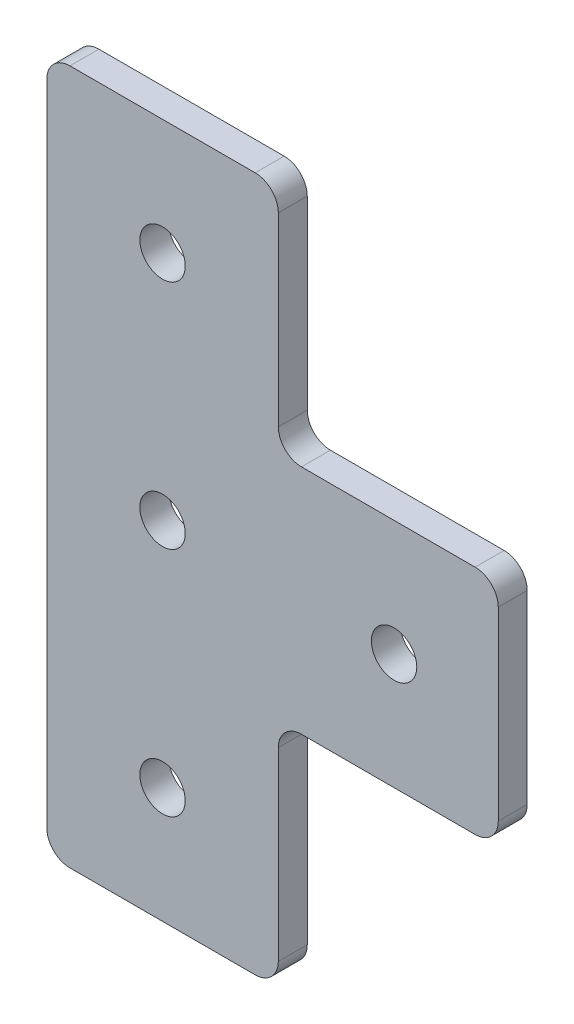
ISO-10303-21;
HEADER;
FILE_DESCRIPTION(('STEP AP214'),'2;1');
FILE_NAME('part.step','',(''),(''),'','','');
FILE_SCHEMA(('AUTOMOTIVE_DESIGN { 1 0 10303 214 1 1 1 1 }'));
ENDSEC;
DATA;
#1=APPLICATION_CONTEXT('core data for automotive mechanical design processes');
#2=APPLICATION_PROTOCOL_DEFINITION('international standard','automotive_design',2000,#1);
#3=PRODUCT_CONTEXT('',#1,'mechanical');
#4=PRODUCT('Part','Part','',(#3));
#5=PRODUCT_RELATED_PRODUCT_CATEGORY('part','',(#4));
#6=PRODUCT_DEFINITION_FORMATION('','',#4);
#7=PRODUCT_DEFINITION_CONTEXT('part definition',#1,'design');
#8=PRODUCT_DEFINITION('design','',#6,#7);
#9=PRODUCT_DEFINITION_SHAPE('','',#8);
#10=(LENGTH_UNIT() NAMED_UNIT(*) SI_UNIT(.MILLI.,.METRE.));
#11=(NAMED_UNIT(*) PLANE_ANGLE_UNIT() SI_UNIT($,.RADIAN.));
#12=(NAMED_UNIT(*) SI_UNIT($,.STERADIAN.) SOLID_ANGLE_UNIT());
#13=UNCERTAINTY_MEASURE_WITH_UNIT(LENGTH_MEASURE(1.E-05),#10,'distance_accuracy_value','');
#14=(GEOMETRIC_REPRESENTATION_CONTEXT(3) GLOBAL_UNCERTAINTY_ASSIGNED_CONTEXT((#13)) GLOBAL_UNIT_ASSIGNED_CONTEXT((#10,
#11,#12)) REPRESENTATION_CONTEXT('',''));
#15=CARTESIAN_POINT('',(0.,0.,0.));
#16=DIRECTION('',(0.,0.,1.));
#17=DIRECTION('',(1.,0.,0.));
#18=AXIS2_PLACEMENT_3D('',#15,#16,#17);
#19=CARTESIAN_POINT('',(-2.54,2.54,3.175));
#20=DIRECTION('',(0.,0.,1.));
#21=DIRECTION('',(1.,0.,0.));
#22=AXIS2_PLACEMENT_3D('',#19,#20,#21);
#23=PLANE('',#22);
#24=CARTESIAN_POINT('',(-36.83,-12.7,3.175));
#25=DIRECTION('',(0.,0.,1.));
#26=DIRECTION('',(1.,0.,0.));
#27=AXIS2_PLACEMENT_3D('',#24,#25,#26);
#28=CIRCLE('',#27,2.4892);
#29=CARTESIAN_POINT('',(-34.3408,-12.7,3.175));
#30=VERTEX_POINT('',#29);
#31=EDGE_CURVE('E343',#30,#30,#28,.T.);
#32=ORIENTED_EDGE('',*,*,#31,.F.);
#33=EDGE_LOOP('',(#32));
#34=FACE_BOUND('',#33,.T.);
#35=CARTESIAN_POINT('',(-36.83,38.1,3.175));
#36=DIRECTION('',(0.,0.,1.));
#37=DIRECTION('',(1.,0.,0.));
#38=AXIS2_PLACEMENT_3D('',#35,#36,#37);
#39=CIRCLE('',#38,2.4892);
#40=CARTESIAN_POINT('',(-34.3408,38.1,3.175));
#41=VERTEX_POINT('',#40);
#42=EDGE_CURVE('E182',#41,#41,#39,.T.);
#43=ORIENTED_EDGE('',*,*,#42,.F.);
#44=EDGE_LOOP('',(#43));
#45=FACE_BOUND('',#44,.T.);
#46=CARTESIAN_POINT('',(-2.54,2.54,3.175));
#47=DIRECTION('',(0.,0.,1.));
#48=DIRECTION('',(1.,0.,0.));
#49=AXIS2_PLACEMENT_3D('',#46,#47,#48);
#50=CIRCLE('',#49,2.54);
#51=CARTESIAN_POINT('',(-2.54000000000002,0.,3.175));
#52=VERTEX_POINT('',#51);
#53=CARTESIAN_POINT('',(0.,2.54000000000002,3.175));
#54=VERTEX_POINT('',#53);
#55=EDGE_CURVE('E209',#52,#54,#50,.T.);
#56=ORIENTED_EDGE('',*,*,#55,.T.);
#57=DIRECTION('',(0.,1.,0.));
#58=VECTOR('',#57,1.);
#59=CARTESIAN_POINT('',(0.,22.86,3.175));
#60=LINE('',#59,#58);
#61=CARTESIAN_POINT('',(0.,22.86,3.175));
#62=VERTEX_POINT('',#61);
#63=EDGE_CURVE('E117',#54,#62,#60,.T.);
#64=ORIENTED_EDGE('',*,*,#63,.T.);
#65=CARTESIAN_POINT('',(-2.54,22.86,3.175));
#66=DIRECTION('',(0.,0.,1.));
#67=DIRECTION('',(-1.,0.,0.));
#68=AXIS2_PLACEMENT_3D('',#65,#66,#67);
#69=CIRCLE('',#68,2.54);
#70=CARTESIAN_POINT('',(-2.54000000000002,25.4,3.175));
#71=VERTEX_POINT('',#70);
#72=EDGE_CURVE('E248',#62,#71,#69,.T.);
#73=ORIENTED_EDGE('',*,*,#72,.T.);
#74=DIRECTION('',(-1.,0.,0.));
#75=VECTOR('',#74,1.);
#76=CARTESIAN_POINT('',(-21.59,25.4,3.175));
#77=LINE('',#76,#75);
#78=CARTESIAN_POINT('',(-21.59,25.4,3.175));
#79=VERTEX_POINT('',#78);
#80=EDGE_CURVE('E267',#71,#79,#77,.T.);
#81=ORIENTED_EDGE('',*,*,#80,.T.);
#82=CARTESIAN_POINT('',(-21.59,27.94,3.175));
#83=DIRECTION('',(0.,0.,-1.));
#84=DIRECTION('',(1.,0.,0.));
#85=AXIS2_PLACEMENT_3D('',#82,#83,#84);
#86=CIRCLE('',#85,2.54);
#87=CARTESIAN_POINT('',(-24.13,27.94,3.175));
#88=VERTEX_POINT('',#87);
#89=EDGE_CURVE('E264',#79,#88,#86,.T.);
#90=ORIENTED_EDGE('',*,*,#89,.T.);
#91=DIRECTION('',(0.,1.,0.));
#92=VECTOR('',#91,1.);
#93=CARTESIAN_POINT('',(-24.13,48.26,3.175));
#94=LINE('',#93,#92);
#95=CARTESIAN_POINT('',(-24.13,48.26,3.175));
#96=VERTEX_POINT('',#95);
#97=EDGE_CURVE('E266',#88,#96,#94,.T.);
#98=ORIENTED_EDGE('',*,*,#97,.T.);
#99=CARTESIAN_POINT('',(-26.67,48.26,3.175));
#100=DIRECTION('',(0.,0.,1.));
#101=DIRECTION('',(-1.,0.,0.));
#102=AXIS2_PLACEMENT_3D('',#99,#100,#101);
#103=CIRCLE('',#102,2.54);
#104=CARTESIAN_POINT('',(-26.67,50.8,3.175));
#105=VERTEX_POINT('',#104);
#106=EDGE_CURVE('E269',#96,#105,#103,.T.);
#107=ORIENTED_EDGE('',*,*,#106,.T.);
#108=DIRECTION('',(-1.,0.,0.));
#109=VECTOR('',#108,1.);
#110=CARTESIAN_POINT('',(-46.99,50.8,3.175));
#111=LINE('',#110,#109);
#112=CARTESIAN_POINT('',(-46.99,50.8,3.175));
#113=VERTEX_POINT('',#112);
#114=EDGE_CURVE('E275',#105,#113,#111,.T.);
#115=ORIENTED_EDGE('',*,*,#114,.T.);
#116=CARTESIAN_POINT('',(-46.99,48.26,3.175));
#117=DIRECTION('',(0.,0.,1.));
#118=DIRECTION('',(-1.,0.,0.));
#119=AXIS2_PLACEMENT_3D('',#116,#117,#118);
#120=CIRCLE('',#119,2.54);
#121=CARTESIAN_POINT('',(-49.53,48.26,3.175));
#122=VERTEX_POINT('',#121);
#123=EDGE_CURVE('E277',#113,#122,#120,.T.);
#124=ORIENTED_EDGE('',*,*,#123,.T.);
#125=DIRECTION('',(0.,-1.,0.));
#126=VECTOR('',#125,1.);
#127=CARTESIAN_POINT('',(-49.53,-22.86,3.175));
#128=LINE('',#127,#126);
#129=CARTESIAN_POINT('',(-49.53,-22.86,3.175));
#130=VERTEX_POINT('',#129);
#131=EDGE_CURVE('E279',#122,#130,#128,.T.);
#132=ORIENTED_EDGE('',*,*,#131,.T.);
#133=CARTESIAN_POINT('',(-46.99,-22.86,3.175));
#134=DIRECTION('',(0.,0.,1.));
#135=DIRECTION('',(-1.,0.,0.));
#136=AXIS2_PLACEMENT_3D('',#133,#134,#135);
#137=CIRCLE('',#136,2.54);
#138=CARTESIAN_POINT('',(-46.99,-25.4,3.175));
#139=VERTEX_POINT('',#138);
#140=EDGE_CURVE('E281',#130,#139,#137,.T.);
#141=ORIENTED_EDGE('',*,*,#140,.T.);
#142=DIRECTION('',(1.,0.,0.));
#143=VECTOR('',#142,1.);
#144=CARTESIAN_POINT('',(-26.67,-25.4,3.175));
#145=LINE('',#144,#143);
#146=CARTESIAN_POINT('',(-26.67,-25.4,3.175));
#147=VERTEX_POINT('',#146);
#148=EDGE_CURVE('E283',#139,#147,#145,.T.);
#149=ORIENTED_EDGE('',*,*,#148,.T.);
#150=CARTESIAN_POINT('',(-26.67,-22.86,3.175));
#151=DIRECTION('',(0.,0.,1.));
#152=DIRECTION('',(-1.,0.,0.));
#153=AXIS2_PLACEMENT_3D('',#150,#151,#152);
#154=CIRCLE('',#153,2.54);
#155=CARTESIAN_POINT('',(-24.13,-22.86,3.175));
#156=VERTEX_POINT('',#155);
#157=EDGE_CURVE('E160',#147,#156,#154,.T.);
#158=ORIENTED_EDGE('',*,*,#157,.T.);
#159=DIRECTION('',(0.,1.,0.));
#160=VECTOR('',#159,1.);
#161=CARTESIAN_POINT('',(-24.13,-2.54000000000002,3.175));
#162=LINE('',#161,#160);
#163=CARTESIAN_POINT('',(-24.13,-2.54000000000002,3.175));
#164=VERTEX_POINT('',#163);
#165=EDGE_CURVE('E154',#156,#164,#162,.T.);
#166=ORIENTED_EDGE('',*,*,#165,.T.);
#167=CARTESIAN_POINT('',(-21.59,-2.54,3.175));
#168=DIRECTION('',(0.,0.,-1.));
#169=DIRECTION('',(1.,0.,0.));
#170=AXIS2_PLACEMENT_3D('',#167,#168,#169);
#171=CIRCLE('',#170,2.54);
#172=CARTESIAN_POINT('',(-21.59,0.,3.175));
#173=VERTEX_POINT('',#172);
#174=EDGE_CURVE('E158',#164,#173,#171,.T.);
#175=ORIENTED_EDGE('',*,*,#174,.T.);
#176=DIRECTION('',(1.,0.,0.));
#177=VECTOR('',#176,1.);
#178=CARTESIAN_POINT('',(-2.54000000000002,0.,3.175));
#179=LINE('',#178,#177);
#180=EDGE_CURVE('E50',#173,#52,#179,.T.);
#181=ORIENTED_EDGE('',*,*,#180,.T.);
#182=EDGE_LOOP('',(#56,#64,#73,#81,#90,#98,#107,#115,#124,#132,#141,#149,#158,#166,#175,#181));
#183=FACE_BOUND('',#182,.T.);
#184=CARTESIAN_POINT('',(-36.83,12.7,3.175));
#185=DIRECTION('',(0.,0.,1.));
#186=DIRECTION('',(1.,0.,0.));
#187=AXIS2_PLACEMENT_3D('',#184,#185,#186);
#188=CIRCLE('',#187,2.4892);
#189=CARTESIAN_POINT('',(-34.3408,12.7,3.175));
#190=VERTEX_POINT('',#189);
#191=EDGE_CURVE('E349',#190,#190,#188,.T.);
#192=ORIENTED_EDGE('',*,*,#191,.F.);
#193=EDGE_LOOP('',(#192));
#194=FACE_BOUND('',#193,.T.);
#195=CARTESIAN_POINT('',(-11.43,12.7,3.175));
#196=DIRECTION('',(0.,0.,1.));
#197=DIRECTION('',(1.,0.,0.));
#198=AXIS2_PLACEMENT_3D('',#195,#196,#197);
#199=CIRCLE('',#198,2.4892);
#200=CARTESIAN_POINT('',(-8.94080000000002,12.7,3.175));
#201=VERTEX_POINT('',#200);
#202=EDGE_CURVE('E334',#201,#201,#199,.T.);
#203=ORIENTED_EDGE('',*,*,#202,.F.);
#204=EDGE_LOOP('',(#203));
#205=FACE_BOUND('',#204,.T.);
#206=ADVANCED_FACE('F33',(#34,#45,#183,#194,#205),#23,.T.);
#207=CARTESIAN_POINT('',(-2.54,2.54,0.));
#208=DIRECTION('',(0.,0.,1.));
#209=DIRECTION('',(1.,0.,0.));
#210=AXIS2_PLACEMENT_3D('',#207,#208,#209);
#211=PLANE('',#210);
#212=CARTESIAN_POINT('',(-2.54,2.54,0.));
#213=DIRECTION('',(0.,0.,1.));
#214=DIRECTION('',(1.,0.,0.));
#215=AXIS2_PLACEMENT_3D('',#212,#213,#214);
#216=CIRCLE('',#215,2.54);
#217=CARTESIAN_POINT('',(-2.54000000000002,0.,0.));
#218=VERTEX_POINT('',#217);
#219=CARTESIAN_POINT('',(0.,2.54000000000002,0.));
#220=VERTEX_POINT('',#219);
#221=EDGE_CURVE('E178',#218,#220,#216,.T.);
#222=ORIENTED_EDGE('',*,*,#221,.F.);
#223=DIRECTION('',(1.,0.,0.));
#224=VECTOR('',#223,1.);
#225=CARTESIAN_POINT('',(-2.54000000000002,0.,0.));
#226=LINE('',#225,#224);
#227=CARTESIAN_POINT('',(-21.59,0.,0.));
#228=VERTEX_POINT('',#227);
#229=EDGE_CURVE('E109',#228,#218,#226,.T.);
#230=ORIENTED_EDGE('',*,*,#229,.F.);
#231=CARTESIAN_POINT('',(-21.59,-2.54,0.));
#232=DIRECTION('',(0.,0.,-1.));
#233=DIRECTION('',(1.,0.,0.));
#234=AXIS2_PLACEMENT_3D('',#231,#232,#233);
#235=CIRCLE('',#234,2.54);
#236=CARTESIAN_POINT('',(-24.13,-2.54000000000002,0.));
#237=VERTEX_POINT('',#236);
#238=EDGE_CURVE('E103',#237,#228,#235,.T.);
#239=ORIENTED_EDGE('',*,*,#238,.F.);
#240=DIRECTION('',(0.,1.,0.));
#241=VECTOR('',#240,1.);
#242=CARTESIAN_POINT('',(-24.13,-2.54000000000002,0.));
#243=LINE('',#242,#241);
#244=CARTESIAN_POINT('',(-24.13,-22.86,0.));
#245=VERTEX_POINT('',#244);
#246=EDGE_CURVE('E168',#245,#237,#243,.T.);
#247=ORIENTED_EDGE('',*,*,#246,.F.);
#248=CARTESIAN_POINT('',(-26.67,-22.86,0.));
#249=DIRECTION('',(0.,0.,1.));
#250=DIRECTION('',(-1.,0.,0.));
#251=AXIS2_PLACEMENT_3D('',#248,#249,#250);
#252=CIRCLE('',#251,2.54);
#253=CARTESIAN_POINT('',(-26.67,-25.4,0.));
#254=VERTEX_POINT('',#253);
#255=EDGE_CURVE('E204',#254,#245,#252,.T.);
#256=ORIENTED_EDGE('',*,*,#255,.F.);
#257=DIRECTION('',(1.,0.,0.));
#258=VECTOR('',#257,1.);
#259=CARTESIAN_POINT('',(-26.67,-25.4,0.));
#260=LINE('',#259,#258);
#261=CARTESIAN_POINT('',(-46.99,-25.4,0.));
#262=VERTEX_POINT('',#261);
#263=EDGE_CURVE('E202',#262,#254,#260,.T.);
#264=ORIENTED_EDGE('',*,*,#263,.F.);
#265=CARTESIAN_POINT('',(-46.99,-22.86,0.));
#266=DIRECTION('',(0.,0.,1.));
#267=DIRECTION('',(-1.,0.,0.));
#268=AXIS2_PLACEMENT_3D('',#265,#266,#267);
#269=CIRCLE('',#268,2.54);
#270=CARTESIAN_POINT('',(-49.53,-22.86,0.));
#271=VERTEX_POINT('',#270);
#272=EDGE_CURVE('E200',#271,#262,#269,.T.);
#273=ORIENTED_EDGE('',*,*,#272,.F.);
#274=DIRECTION('',(0.,-1.,0.));
#275=VECTOR('',#274,1.);
#276=CARTESIAN_POINT('',(-49.53,-22.86,0.));
#277=LINE('',#276,#275);
#278=CARTESIAN_POINT('',(-49.53,48.26,0.));
#279=VERTEX_POINT('',#278);
#280=EDGE_CURVE('E198',#279,#271,#277,.T.);
#281=ORIENTED_EDGE('',*,*,#280,.F.);
#282=CARTESIAN_POINT('',(-46.99,48.26,0.));
#283=DIRECTION('',(0.,0.,1.));
#284=DIRECTION('',(-1.,0.,0.));
#285=AXIS2_PLACEMENT_3D('',#282,#283,#284);
#286=CIRCLE('',#285,2.54);
#287=CARTESIAN_POINT('',(-46.99,50.8,0.));
#288=VERTEX_POINT('',#287);
#289=EDGE_CURVE('E196',#288,#279,#286,.T.);
#290=ORIENTED_EDGE('',*,*,#289,.F.);
#291=DIRECTION('',(-1.,0.,0.));
#292=VECTOR('',#291,1.);
#293=CARTESIAN_POINT('',(-46.99,50.8,0.));
#294=LINE('',#293,#292);
#295=CARTESIAN_POINT('',(-26.67,50.8,0.));
#296=VERTEX_POINT('',#295);
#297=EDGE_CURVE('E194',#296,#288,#294,.T.);
#298=ORIENTED_EDGE('',*,*,#297,.F.);
#299=CARTESIAN_POINT('',(-26.67,48.26,0.));
#300=DIRECTION('',(0.,0.,1.));
#301=DIRECTION('',(-1.,0.,0.));
#302=AXIS2_PLACEMENT_3D('',#299,#300,#301);
#303=CIRCLE('',#302,2.54);
#304=CARTESIAN_POINT('',(-24.13,48.26,0.));
#305=VERTEX_POINT('',#304);
#306=EDGE_CURVE('E192',#305,#296,#303,.T.);
#307=ORIENTED_EDGE('',*,*,#306,.F.);
#308=DIRECTION('',(0.,1.,0.));
#309=VECTOR('',#308,1.);
#310=CARTESIAN_POINT('',(-24.13,48.26,0.));
#311=LINE('',#310,#309);
#312=CARTESIAN_POINT('',(-24.13,27.94,0.));
#313=VERTEX_POINT('',#312);
#314=EDGE_CURVE('E190',#313,#305,#311,.T.);
#315=ORIENTED_EDGE('',*,*,#314,.F.);
#316=CARTESIAN_POINT('',(-21.59,27.94,0.));
#317=DIRECTION('',(0.,0.,-1.));
#318=DIRECTION('',(1.,0.,0.));
#319=AXIS2_PLACEMENT_3D('',#316,#317,#318);
#320=CIRCLE('',#319,2.54);
#321=CARTESIAN_POINT('',(-21.59,25.4,0.));
#322=VERTEX_POINT('',#321);
#323=EDGE_CURVE('E188',#322,#313,#320,.T.);
#324=ORIENTED_EDGE('',*,*,#323,.F.);
#325=DIRECTION('',(-1.,0.,0.));
#326=VECTOR('',#325,1.);
#327=CARTESIAN_POINT('',(-21.59,25.4,0.));
#328=LINE('',#327,#326);
#329=CARTESIAN_POINT('',(-2.54000000000002,25.4,0.));
#330=VERTEX_POINT('',#329);
#331=EDGE_CURVE('E186',#330,#322,#328,.T.);
#332=ORIENTED_EDGE('',*,*,#331,.F.);
#333=CARTESIAN_POINT('',(-2.54,22.86,0.));
#334=DIRECTION('',(0.,0.,1.));
#335=DIRECTION('',(-1.,0.,0.));
#336=AXIS2_PLACEMENT_3D('',#333,#334,#335);
#337=CIRCLE('',#336,2.54);
#338=CARTESIAN_POINT('',(0.,22.86,0.));
#339=VERTEX_POINT('',#338);
#340=EDGE_CURVE('E184',#339,#330,#337,.T.);
#341=ORIENTED_EDGE('',*,*,#340,.F.);
#342=DIRECTION('',(0.,1.,0.));
#343=VECTOR('',#342,1.);
#344=CARTESIAN_POINT('',(0.,22.86,0.));
#345=LINE('',#344,#343);
#346=EDGE_CURVE('E181',#220,#339,#345,.T.);
#347=ORIENTED_EDGE('',*,*,#346,.F.);
#348=EDGE_LOOP('',(#222,#230,#239,#247,#256,#264,#273,#281,#290,#298,#307,#315,#324,#332,#341,#347));
#349=FACE_BOUND('',#348,.T.);
#350=CARTESIAN_POINT('',(-36.83,38.1,0.));
#351=DIRECTION('',(0.,0.,1.));
#352=DIRECTION('',(1.,0.,0.));
#353=AXIS2_PLACEMENT_3D('',#350,#351,#352);
#354=CIRCLE('',#353,2.4892);
#355=CARTESIAN_POINT('',(-34.3408,38.1,0.));
#356=VERTEX_POINT('',#355);
#357=EDGE_CURVE('E352',#356,#356,#354,.T.);
#358=ORIENTED_EDGE('',*,*,#357,.T.);
#359=EDGE_LOOP('',(#358));
#360=FACE_BOUND('',#359,.T.);
#361=CARTESIAN_POINT('',(-36.83,12.7,0.));
#362=DIRECTION('',(0.,0.,1.));
#363=DIRECTION('',(1.,0.,0.));
#364=AXIS2_PLACEMENT_3D('',#361,#362,#363);
#365=CIRCLE('',#364,2.4892);
#366=CARTESIAN_POINT('',(-34.3408,12.7,0.));
#367=VERTEX_POINT('',#366);
#368=EDGE_CURVE('E346',#367,#367,#365,.T.);
#369=ORIENTED_EDGE('',*,*,#368,.T.);
#370=EDGE_LOOP('',(#369));
#371=FACE_BOUND('',#370,.T.);
#372=CARTESIAN_POINT('',(-36.83,-12.7,0.));
#373=DIRECTION('',(0.,0.,1.));
#374=DIRECTION('',(1.,0.,0.));
#375=AXIS2_PLACEMENT_3D('',#372,#373,#374);
#376=CIRCLE('',#375,2.4892);
#377=CARTESIAN_POINT('',(-34.3408,-12.7,0.));
#378=VERTEX_POINT('',#377);
#379=EDGE_CURVE('E340',#378,#378,#376,.T.);
#380=ORIENTED_EDGE('',*,*,#379,.T.);
#381=EDGE_LOOP('',(#380));
#382=FACE_BOUND('',#381,.T.);
#383=CARTESIAN_POINT('',(-11.43,12.7,0.));
#384=DIRECTION('',(0.,0.,1.));
#385=DIRECTION('',(1.,0.,0.));
#386=AXIS2_PLACEMENT_3D('',#383,#384,#385);
#387=CIRCLE('',#386,2.4892);
#388=CARTESIAN_POINT('',(-8.94080000000002,12.7,0.));
#389=VERTEX_POINT('',#388);
#390=EDGE_CURVE('E337',#389,#389,#387,.T.);
#391=ORIENTED_EDGE('',*,*,#390,.T.);
#392=EDGE_LOOP('',(#391));
#393=FACE_BOUND('',#392,.T.);
#394=ADVANCED_FACE('F252',(#349,#360,#371,#382,#393),#211,.F.);
#395=CARTESIAN_POINT('',(-2.54,2.54,3.175));
#396=DIRECTION('',(0.,0.,-1.));
#397=DIRECTION('',(-1.,0.,0.));
#398=AXIS2_PLACEMENT_3D('',#395,#396,#397);
#399=CYLINDRICAL_SURFACE('',#398,2.54);
#400=ORIENTED_EDGE('',*,*,#221,.T.);
#401=DIRECTION('',(0.,0.,-1.));
#402=VECTOR('',#401,1.);
#403=CARTESIAN_POINT('',(0.,2.54000000000002,3.175));
#404=LINE('',#403,#402);
#405=EDGE_CURVE('E11',#54,#220,#404,.T.);
#406=ORIENTED_EDGE('',*,*,#405,.F.);
#407=ORIENTED_EDGE('',*,*,#55,.F.);
#408=DIRECTION('',(0.,0.,-1.));
#409=VECTOR('',#408,1.);
#410=CARTESIAN_POINT('',(-2.54000000000002,0.,3.175));
#411=LINE('',#410,#409);
#412=EDGE_CURVE('E174',#52,#218,#411,.T.);
#413=ORIENTED_EDGE('',*,*,#412,.T.);
#414=EDGE_LOOP('',(#400,#406,#407,#413));
#415=FACE_BOUND('',#414,.T.);
#416=ADVANCED_FACE('F35',(#415),#399,.T.);
#417=CARTESIAN_POINT('',(0.,22.86,3.175));
#418=DIRECTION('',(-1.,0.,0.));
#419=DIRECTION('',(0.,0.,1.));
#420=AXIS2_PLACEMENT_3D('',#417,#418,#419);
#421=PLANE('',#420);
#422=ORIENTED_EDGE('',*,*,#346,.T.);
#423=DIRECTION('',(0.,0.,-1.));
#424=VECTOR('',#423,1.);
#425=CARTESIAN_POINT('',(0.,22.86,3.175));
#426=LINE('',#425,#424);
#427=EDGE_CURVE('E42',#62,#339,#426,.T.);
#428=ORIENTED_EDGE('',*,*,#427,.F.);
#429=ORIENTED_EDGE('',*,*,#63,.F.);
#430=ORIENTED_EDGE('',*,*,#405,.T.);
#431=EDGE_LOOP('',(#422,#428,#429,#430));
#432=FACE_BOUND('',#431,.T.);
#433=ADVANCED_FACE('F502',(#432),#421,.F.);
#434=CARTESIAN_POINT('',(-2.54,22.86,3.175));
#435=DIRECTION('',(0.,0.,-1.));
#436=DIRECTION('',(-1.,0.,0.));
#437=AXIS2_PLACEMENT_3D('',#434,#435,#436);
#438=CYLINDRICAL_SURFACE('',#437,2.54);
#439=ORIENTED_EDGE('',*,*,#340,.T.);
#440=DIRECTION('',(0.,0.,-1.));
#441=VECTOR('',#440,1.);
#442=CARTESIAN_POINT('',(-2.54000000000002,25.4,3.175));
#443=LINE('',#442,#441);
#444=EDGE_CURVE('E240',#71,#330,#443,.T.);
#445=ORIENTED_EDGE('',*,*,#444,.F.);
#446=ORIENTED_EDGE('',*,*,#72,.F.);
#447=ORIENTED_EDGE('',*,*,#427,.T.);
#448=EDGE_LOOP('',(#439,#445,#446,#447));
#449=FACE_BOUND('',#448,.T.);
#450=ADVANCED_FACE('F246',(#449),#438,.T.);
#451=CARTESIAN_POINT('',(-21.59,25.4,3.175));
#452=DIRECTION('',(0.,-1.,0.));
#453=DIRECTION('',(1.,0.,0.));
#454=AXIS2_PLACEMENT_3D('',#451,#452,#453);
#455=PLANE('',#454);
#456=ORIENTED_EDGE('',*,*,#331,.T.);
#457=DIRECTION('',(0.,0.,-1.));
#458=VECTOR('',#457,1.);
#459=CARTESIAN_POINT('',(-21.59,25.4,3.175));
#460=LINE('',#459,#458);
#461=EDGE_CURVE('E237',#79,#322,#460,.T.);
#462=ORIENTED_EDGE('',*,*,#461,.F.);
#463=ORIENTED_EDGE('',*,*,#80,.F.);
#464=ORIENTED_EDGE('',*,*,#444,.T.);
#465=EDGE_LOOP('',(#456,#462,#463,#464));
#466=FACE_BOUND('',#465,.T.);
#467=ADVANCED_FACE('F258',(#466),#455,.F.);
#468=CARTESIAN_POINT('',(-21.59,27.94,3.175));
#469=DIRECTION('',(0.,0.,-1.));
#470=DIRECTION('',(-1.,0.,0.));
#471=AXIS2_PLACEMENT_3D('',#468,#469,#470);
#472=CYLINDRICAL_SURFACE('',#471,2.54);
#473=ORIENTED_EDGE('',*,*,#323,.T.);
#474=DIRECTION('',(0.,0.,-1.));
#475=VECTOR('',#474,1.);
#476=CARTESIAN_POINT('',(-24.13,27.94,3.175));
#477=LINE('',#476,#475);
#478=EDGE_CURVE('E234',#88,#313,#477,.T.);
#479=ORIENTED_EDGE('',*,*,#478,.F.);
#480=ORIENTED_EDGE('',*,*,#89,.F.);
#481=ORIENTED_EDGE('',*,*,#461,.T.);
#482=EDGE_LOOP('',(#473,#479,#480,#481));
#483=FACE_BOUND('',#482,.T.);
#484=ADVANCED_FACE('F262',(#483),#472,.F.);
#485=CARTESIAN_POINT('',(-24.13,48.26,3.175));
#486=DIRECTION('',(-1.,0.,0.));
#487=DIRECTION('',(0.,-1.,0.));
#488=AXIS2_PLACEMENT_3D('',#485,#486,#487);
#489=PLANE('',#488);
#490=ORIENTED_EDGE('',*,*,#314,.T.);
#491=DIRECTION('',(0.,0.,-1.));
#492=VECTOR('',#491,1.);
#493=CARTESIAN_POINT('',(-24.13,48.26,3.175));
#494=LINE('',#493,#492);
#495=EDGE_CURVE('E231',#96,#305,#494,.T.);
#496=ORIENTED_EDGE('',*,*,#495,.F.);
#497=ORIENTED_EDGE('',*,*,#97,.F.);
#498=ORIENTED_EDGE('',*,*,#478,.T.);
#499=EDGE_LOOP('',(#490,#496,#497,#498));
#500=FACE_BOUND('',#499,.T.);
#501=ADVANCED_FACE('F467',(#500),#489,.F.);
#502=CARTESIAN_POINT('',(-26.67,48.26,3.175));
#503=DIRECTION('',(0.,0.,-1.));
#504=DIRECTION('',(-1.,0.,0.));
#505=AXIS2_PLACEMENT_3D('',#502,#503,#504);
#506=CYLINDRICAL_SURFACE('',#505,2.54);
#507=ORIENTED_EDGE('',*,*,#306,.T.);
#508=DIRECTION('',(0.,0.,-1.));
#509=VECTOR('',#508,1.);
#510=CARTESIAN_POINT('',(-26.67,50.8,3.175));
#511=LINE('',#510,#509);
#512=EDGE_CURVE('E228',#105,#296,#511,.T.);
#513=ORIENTED_EDGE('',*,*,#512,.F.);
#514=ORIENTED_EDGE('',*,*,#106,.F.);
#515=ORIENTED_EDGE('',*,*,#495,.T.);
#516=EDGE_LOOP('',(#507,#513,#514,#515));
#517=FACE_BOUND('',#516,.T.);
#518=ADVANCED_FACE('F457',(#517),#506,.T.);
#519=CARTESIAN_POINT('',(-46.99,50.8,3.175));
#520=DIRECTION('',(0.,-1.,0.));
#521=DIRECTION('',(0.,0.,-1.));
#522=AXIS2_PLACEMENT_3D('',#519,#520,#521);
#523=PLANE('',#522);
#524=ORIENTED_EDGE('',*,*,#297,.T.);
#525=DIRECTION('',(0.,0.,-1.));
#526=VECTOR('',#525,1.);
#527=CARTESIAN_POINT('',(-46.99,50.8,3.175));
#528=LINE('',#527,#526);
#529=EDGE_CURVE('E225',#113,#288,#528,.T.);
#530=ORIENTED_EDGE('',*,*,#529,.F.);
#531=ORIENTED_EDGE('',*,*,#114,.F.);
#532=ORIENTED_EDGE('',*,*,#512,.T.);
#533=EDGE_LOOP('',(#524,#530,#531,#532));
#534=FACE_BOUND('',#533,.T.);
#535=ADVANCED_FACE('F447',(#534),#523,.F.);
#536=CARTESIAN_POINT('',(-46.99,48.26,3.175));
#537=DIRECTION('',(0.,0.,-1.));
#538=DIRECTION('',(-1.,0.,0.));
#539=AXIS2_PLACEMENT_3D('',#536,#537,#538);
#540=CYLINDRICAL_SURFACE('',#539,2.54);
#541=ORIENTED_EDGE('',*,*,#289,.T.);
#542=DIRECTION('',(0.,0.,-1.));
#543=VECTOR('',#542,1.);
#544=CARTESIAN_POINT('',(-49.53,48.26,3.175));
#545=LINE('',#544,#543);
#546=EDGE_CURVE('E222',#122,#279,#545,.T.);
#547=ORIENTED_EDGE('',*,*,#546,.F.);
#548=ORIENTED_EDGE('',*,*,#123,.F.);
#549=ORIENTED_EDGE('',*,*,#529,.T.);
#550=EDGE_LOOP('',(#541,#547,#548,#549));
#551=FACE_BOUND('',#550,.T.);
#552=ADVANCED_FACE('F437',(#551),#540,.T.);
#553=CARTESIAN_POINT('',(-49.53,-22.86,3.175));
#554=DIRECTION('',(1.,0.,0.));
#555=DIRECTION('',(0.,0.,-1.));
#556=AXIS2_PLACEMENT_3D('',#553,#554,#555);
#557=PLANE('',#556);
#558=ORIENTED_EDGE('',*,*,#280,.T.);
#559=DIRECTION('',(0.,0.,-1.));
#560=VECTOR('',#559,1.);
#561=CARTESIAN_POINT('',(-49.53,-22.86,3.175));
#562=LINE('',#561,#560);
#563=EDGE_CURVE('E219',#130,#271,#562,.T.);
#564=ORIENTED_EDGE('',*,*,#563,.F.);
#565=ORIENTED_EDGE('',*,*,#131,.F.);
#566=ORIENTED_EDGE('',*,*,#546,.T.);
#567=EDGE_LOOP('',(#558,#564,#565,#566));
#568=FACE_BOUND('',#567,.T.);
#569=ADVANCED_FACE('F427',(#568),#557,.F.);
#570=CARTESIAN_POINT('',(-46.99,-22.86,3.175));
#571=DIRECTION('',(0.,0.,-1.));
#572=DIRECTION('',(-1.,0.,0.));
#573=AXIS2_PLACEMENT_3D('',#570,#571,#572);
#574=CYLINDRICAL_SURFACE('',#573,2.54);
#575=ORIENTED_EDGE('',*,*,#272,.T.);
#576=DIRECTION('',(0.,0.,-1.));
#577=VECTOR('',#576,1.);
#578=CARTESIAN_POINT('',(-46.99,-25.4,3.175));
#579=LINE('',#578,#577);
#580=EDGE_CURVE('E216',#139,#262,#579,.T.);
#581=ORIENTED_EDGE('',*,*,#580,.F.);
#582=ORIENTED_EDGE('',*,*,#140,.F.);
#583=ORIENTED_EDGE('',*,*,#563,.T.);
#584=EDGE_LOOP('',(#575,#581,#582,#583));
#585=FACE_BOUND('',#584,.T.);
#586=ADVANCED_FACE('F418',(#585),#574,.T.);
#587=CARTESIAN_POINT('',(-26.67,-25.4,3.175));
#588=DIRECTION('',(0.,1.,0.));
#589=DIRECTION('',(0.,0.,1.));
#590=AXIS2_PLACEMENT_3D('',#587,#588,#589);
#591=PLANE('',#590);
#592=ORIENTED_EDGE('',*,*,#263,.T.);
#593=DIRECTION('',(0.,0.,-1.));
#594=VECTOR('',#593,1.);
#595=CARTESIAN_POINT('',(-26.67,-25.4,3.175));
#596=LINE('',#595,#594);
#597=EDGE_CURVE('E213',#147,#254,#596,.T.);
#598=ORIENTED_EDGE('',*,*,#597,.F.);
#599=ORIENTED_EDGE('',*,*,#148,.F.);
#600=ORIENTED_EDGE('',*,*,#580,.T.);
#601=EDGE_LOOP('',(#592,#598,#599,#600));
#602=FACE_BOUND('',#601,.T.);
#603=ADVANCED_FACE('F289',(#602),#591,.F.);
#604=CARTESIAN_POINT('',(-26.67,-22.86,3.175));
#605=DIRECTION('',(0.,0.,-1.));
#606=DIRECTION('',(-1.,0.,0.));
#607=AXIS2_PLACEMENT_3D('',#604,#605,#606);
#608=CYLINDRICAL_SURFACE('',#607,2.54);
#609=ORIENTED_EDGE('',*,*,#255,.T.);
#610=DIRECTION('',(0.,0.,-1.));
#611=VECTOR('',#610,1.);
#612=CARTESIAN_POINT('',(-24.13,-22.86,3.175));
#613=LINE('',#612,#611);
#614=EDGE_CURVE('E169',#156,#245,#613,.T.);
#615=ORIENTED_EDGE('',*,*,#614,.F.);
#616=ORIENTED_EDGE('',*,*,#157,.F.);
#617=ORIENTED_EDGE('',*,*,#597,.T.);
#618=EDGE_LOOP('',(#609,#615,#616,#617));
#619=FACE_BOUND('',#618,.T.);
#620=ADVANCED_FACE('F293',(#619),#608,.T.);
#621=CARTESIAN_POINT('',(-24.13,-2.54000000000002,3.175));
#622=DIRECTION('',(-1.,0.,0.));
#623=DIRECTION('',(0.,-1.,0.));
#624=AXIS2_PLACEMENT_3D('',#621,#622,#623);
#625=PLANE('',#624);
#626=ORIENTED_EDGE('',*,*,#246,.T.);
#627=DIRECTION('',(0.,0.,-1.));
#628=VECTOR('',#627,1.);
#629=CARTESIAN_POINT('',(-24.13,-2.54000000000002,3.175));
#630=LINE('',#629,#628);
#631=EDGE_CURVE('E165',#164,#237,#630,.T.);
#632=ORIENTED_EDGE('',*,*,#631,.F.);
#633=ORIENTED_EDGE('',*,*,#165,.F.);
#634=ORIENTED_EDGE('',*,*,#614,.T.);
#635=EDGE_LOOP('',(#626,#632,#633,#634));
#636=FACE_BOUND('',#635,.T.);
#637=ADVANCED_FACE('F166',(#636),#625,.F.);
#638=CARTESIAN_POINT('',(-21.59,-2.54,3.175));
#639=DIRECTION('',(0.,0.,-1.));
#640=DIRECTION('',(-1.,0.,0.));
#641=AXIS2_PLACEMENT_3D('',#638,#639,#640);
#642=CYLINDRICAL_SURFACE('',#641,2.54);
#643=ORIENTED_EDGE('',*,*,#238,.T.);
#644=DIRECTION('',(0.,0.,-1.));
#645=VECTOR('',#644,1.);
#646=CARTESIAN_POINT('',(-21.59,0.,3.175));
#647=LINE('',#646,#645);
#648=EDGE_CURVE('E170',#173,#228,#647,.T.);
#649=ORIENTED_EDGE('',*,*,#648,.F.);
#650=ORIENTED_EDGE('',*,*,#174,.F.);
#651=ORIENTED_EDGE('',*,*,#631,.T.);
#652=EDGE_LOOP('',(#643,#649,#650,#651));
#653=FACE_BOUND('',#652,.T.);
#654=ADVANCED_FACE('F172',(#653),#642,.F.);
#655=CARTESIAN_POINT('',(-2.54000000000002,0.,3.175));
#656=DIRECTION('',(0.,1.,0.));
#657=DIRECTION('',(-1.,0.,0.));
#658=AXIS2_PLACEMENT_3D('',#655,#656,#657);
#659=PLANE('',#658);
#660=ORIENTED_EDGE('',*,*,#229,.T.);
#661=ORIENTED_EDGE('',*,*,#412,.F.);
#662=ORIENTED_EDGE('',*,*,#180,.F.);
#663=ORIENTED_EDGE('',*,*,#648,.T.);
#664=EDGE_LOOP('',(#660,#661,#662,#663));
#665=FACE_BOUND('',#664,.T.);
#666=ADVANCED_FACE('F297',(#665),#659,.F.);
#667=CARTESIAN_POINT('',(-36.83,38.1,3.175));
#668=DIRECTION('',(0.,0.,-1.));
#669=DIRECTION('',(-1.,0.,0.));
#670=AXIS2_PLACEMENT_3D('',#667,#668,#669);
#671=CYLINDRICAL_SURFACE('',#670,2.4892);
#672=ORIENTED_EDGE('',*,*,#42,.T.);
#673=EDGE_LOOP('',(#672));
#674=FACE_BOUND('',#673,.T.);
#675=ORIENTED_EDGE('',*,*,#357,.F.);
#676=EDGE_LOOP('',(#675));
#677=FACE_BOUND('',#676,.T.);
#678=ADVANCED_FACE('F299',(#674,#677),#671,.F.);
#679=CARTESIAN_POINT('',(-36.83,12.7,3.175));
#680=DIRECTION('',(0.,0.,-1.));
#681=DIRECTION('',(-1.,0.,0.));
#682=AXIS2_PLACEMENT_3D('',#679,#680,#681);
#683=CYLINDRICAL_SURFACE('',#682,2.4892);
#684=ORIENTED_EDGE('',*,*,#191,.T.);
#685=EDGE_LOOP('',(#684));
#686=FACE_BOUND('',#685,.T.);
#687=ORIENTED_EDGE('',*,*,#368,.F.);
#688=EDGE_LOOP('',(#687));
#689=FACE_BOUND('',#688,.T.);
#690=ADVANCED_FACE('F305',(#686,#689),#683,.F.);
#691=CARTESIAN_POINT('',(-36.83,-12.7,3.175));
#692=DIRECTION('',(0.,0.,-1.));
#693=DIRECTION('',(-1.,0.,0.));
#694=AXIS2_PLACEMENT_3D('',#691,#692,#693);
#695=CYLINDRICAL_SURFACE('',#694,2.4892);
#696=ORIENTED_EDGE('',*,*,#31,.T.);
#697=EDGE_LOOP('',(#696));
#698=FACE_BOUND('',#697,.T.);
#699=ORIENTED_EDGE('',*,*,#379,.F.);
#700=EDGE_LOOP('',(#699));
#701=FACE_BOUND('',#700,.T.);
#702=ADVANCED_FACE('F321',(#698,#701),#695,.F.);
#703=CARTESIAN_POINT('',(-11.43,12.7,3.175));
#704=DIRECTION('',(0.,0.,-1.));
#705=DIRECTION('',(-1.,0.,0.));
#706=AXIS2_PLACEMENT_3D('',#703,#704,#705);
#707=CYLINDRICAL_SURFACE('',#706,2.4892);
#708=ORIENTED_EDGE('',*,*,#202,.T.);
#709=EDGE_LOOP('',(#708));
#710=FACE_BOUND('',#709,.T.);
#711=ORIENTED_EDGE('',*,*,#390,.F.);
#712=EDGE_LOOP('',(#711));
#713=FACE_BOUND('',#712,.T.);
#714=ADVANCED_FACE('F325',(#710,#713),#707,.F.);
#715=CLOSED_SHELL('',(#206,#394,#416,#433,#450,#467,#484,#501,#518,#535,#552,#569,#586,#603,
#620,#637,#654,#666,#678,#690,#702,#714));
#716=MANIFOLD_SOLID_BREP('B2',#715);
#717=ADVANCED_BREP_SHAPE_REPRESENTATION('',(#18,#716),#14);
#718=SHAPE_DEFINITION_REPRESENTATION(#9,#717);
ENDSEC;
END-ISO-10303-21;
